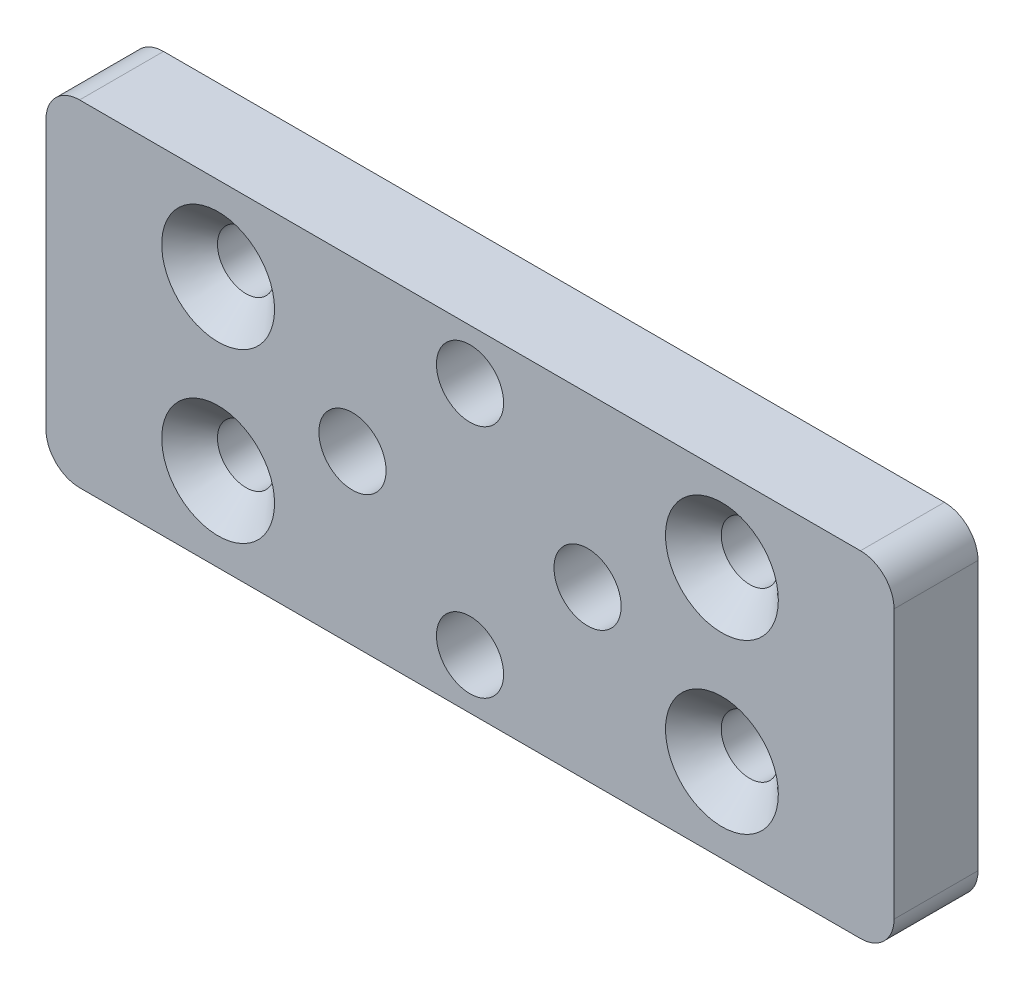
ISO-10303-21;
HEADER;
FILE_DESCRIPTION(('STEP AP214'),'2;1');
FILE_NAME('part.step','',(''),(''),'','','');
FILE_SCHEMA(('AUTOMOTIVE_DESIGN { 1 0 10303 214 1 1 1 1 }'));
ENDSEC;
DATA;
#1=APPLICATION_CONTEXT('core data for automotive mechanical design processes');
#2=APPLICATION_PROTOCOL_DEFINITION('international standard','automotive_design',2000,#1);
#3=PRODUCT_CONTEXT('',#1,'mechanical');
#4=PRODUCT('Part','Part','',(#3));
#5=PRODUCT_RELATED_PRODUCT_CATEGORY('part','',(#4));
#6=PRODUCT_DEFINITION_FORMATION('','',#4);
#7=PRODUCT_DEFINITION_CONTEXT('part definition',#1,'design');
#8=PRODUCT_DEFINITION('design','',#6,#7);
#9=PRODUCT_DEFINITION_SHAPE('','',#8);
#10=(LENGTH_UNIT() NAMED_UNIT(*) SI_UNIT(.MILLI.,.METRE.));
#11=(NAMED_UNIT(*) PLANE_ANGLE_UNIT() SI_UNIT($,.RADIAN.));
#12=(NAMED_UNIT(*) SI_UNIT($,.STERADIAN.) SOLID_ANGLE_UNIT());
#13=UNCERTAINTY_MEASURE_WITH_UNIT(LENGTH_MEASURE(1.E-05),#10,'distance_accuracy_value','');
#14=(GEOMETRIC_REPRESENTATION_CONTEXT(3) GLOBAL_UNCERTAINTY_ASSIGNED_CONTEXT((#13)) GLOBAL_UNIT_ASSIGNED_CONTEXT((#10,
#11,#12)) REPRESENTATION_CONTEXT('',''));
#15=CARTESIAN_POINT('',(0.,0.,0.));
#16=DIRECTION('',(0.,0.,1.));
#17=DIRECTION('',(1.,0.,0.));
#18=AXIS2_PLACEMENT_3D('',#15,#16,#17);
#19=CARTESIAN_POINT('',(0.,0.,5.));
#20=DIRECTION('',(1.,0.,0.));
#21=DIRECTION('',(0.,1.,0.));
#22=AXIS2_PLACEMENT_3D('',#19,#20,#21);
#23=PLANE('',#22);
#24=DIRECTION('',(0.,-1.,0.));
#25=VECTOR('',#24,1.);
#26=CARTESIAN_POINT('',(0.,0.,0.));
#27=LINE('',#26,#25);
#28=CARTESIAN_POINT('',(0.,-2.,0.));
#29=VERTEX_POINT('',#28);
#30=CARTESIAN_POINT('',(0.,-18.,0.));
#31=VERTEX_POINT('',#30);
#32=EDGE_CURVE('E158',#29,#31,#27,.T.);
#33=ORIENTED_EDGE('',*,*,#32,.T.);
#34=DIRECTION('',(0.,0.,-1.));
#35=VECTOR('',#34,1.);
#36=CARTESIAN_POINT('',(0.,-18.,5.));
#37=LINE('',#36,#35);
#38=CARTESIAN_POINT('',(0.,-18.,5.));
#39=VERTEX_POINT('',#38);
#40=EDGE_CURVE('E11',#31,#39,#37,.F.);
#41=ORIENTED_EDGE('',*,*,#40,.T.);
#42=DIRECTION('',(0.,-1.,0.));
#43=VECTOR('',#42,1.);
#44=CARTESIAN_POINT('',(0.,0.,5.));
#45=LINE('',#44,#43);
#46=CARTESIAN_POINT('',(0.,-2.,5.));
#47=VERTEX_POINT('',#46);
#48=EDGE_CURVE('E126',#47,#39,#45,.T.);
#49=ORIENTED_EDGE('',*,*,#48,.F.);
#50=DIRECTION('',(0.,0.,-1.));
#51=VECTOR('',#50,1.);
#52=CARTESIAN_POINT('',(0.,-2.,5.));
#53=LINE('',#52,#51);
#54=EDGE_CURVE('E42',#47,#29,#53,.T.);
#55=ORIENTED_EDGE('',*,*,#54,.T.);
#56=EDGE_LOOP('',(#33,#41,#49,#55));
#57=FACE_BOUND('',#56,.T.);
#58=ADVANCED_FACE('F34',(#57),#23,.F.);
#59=CARTESIAN_POINT('',(0.,-20.,5.));
#60=DIRECTION('',(0.,1.,0.));
#61=DIRECTION('',(0.,0.,1.));
#62=AXIS2_PLACEMENT_3D('',#59,#60,#61);
#63=PLANE('',#62);
#64=DIRECTION('',(1.,0.,0.));
#65=VECTOR('',#64,1.);
#66=CARTESIAN_POINT('',(0.,-20.,0.));
#67=LINE('',#66,#65);
#68=CARTESIAN_POINT('',(2.,-20.,0.));
#69=VERTEX_POINT('',#68);
#70=CARTESIAN_POINT('',(48.5,-20.,0.));
#71=VERTEX_POINT('',#70);
#72=EDGE_CURVE('E131',#69,#71,#67,.T.);
#73=ORIENTED_EDGE('',*,*,#72,.T.);
#74=DIRECTION('',(0.,0.,-1.));
#75=VECTOR('',#74,1.);
#76=CARTESIAN_POINT('',(48.5,-20.,5.));
#77=LINE('',#76,#75);
#78=CARTESIAN_POINT('',(48.5,-20.,5.));
#79=VERTEX_POINT('',#78);
#80=EDGE_CURVE('E49',#71,#79,#77,.F.);
#81=ORIENTED_EDGE('',*,*,#80,.T.);
#82=DIRECTION('',(1.,0.,0.));
#83=VECTOR('',#82,1.);
#84=CARTESIAN_POINT('',(0.,-20.,5.));
#85=LINE('',#84,#83);
#86=CARTESIAN_POINT('',(2.,-20.,5.));
#87=VERTEX_POINT('',#86);
#88=EDGE_CURVE('E129',#87,#79,#85,.T.);
#89=ORIENTED_EDGE('',*,*,#88,.F.);
#90=DIRECTION('',(0.,0.,-1.));
#91=VECTOR('',#90,1.);
#92=CARTESIAN_POINT('',(2.,-20.,5.));
#93=LINE('',#92,#91);
#94=EDGE_CURVE('E150',#87,#69,#93,.T.);
#95=ORIENTED_EDGE('',*,*,#94,.T.);
#96=EDGE_LOOP('',(#73,#81,#89,#95));
#97=FACE_BOUND('',#96,.T.);
#98=ADVANCED_FACE('F264',(#97),#63,.F.);
#99=CARTESIAN_POINT('',(50.5,0.,5.));
#100=DIRECTION('',(-1.,0.,0.));
#101=DIRECTION('',(0.,0.,1.));
#102=AXIS2_PLACEMENT_3D('',#99,#100,#101);
#103=PLANE('',#102);
#104=DIRECTION('',(0.,1.,0.));
#105=VECTOR('',#104,1.);
#106=CARTESIAN_POINT('',(50.5,0.,0.));
#107=LINE('',#106,#105);
#108=CARTESIAN_POINT('',(50.5,-18.,0.));
#109=VERTEX_POINT('',#108);
#110=CARTESIAN_POINT('',(50.5,-2.,0.));
#111=VERTEX_POINT('',#110);
#112=EDGE_CURVE('E127',#109,#111,#107,.T.);
#113=ORIENTED_EDGE('',*,*,#112,.T.);
#114=DIRECTION('',(0.,0.,-1.));
#115=VECTOR('',#114,1.);
#116=CARTESIAN_POINT('',(50.5,-2.,5.));
#117=LINE('',#116,#115);
#118=CARTESIAN_POINT('',(50.5,-2.,5.));
#119=VERTEX_POINT('',#118);
#120=EDGE_CURVE('E105',#111,#119,#117,.F.);
#121=ORIENTED_EDGE('',*,*,#120,.T.);
#122=DIRECTION('',(0.,1.,0.));
#123=VECTOR('',#122,1.);
#124=CARTESIAN_POINT('',(50.5,0.,5.));
#125=LINE('',#124,#123);
#126=CARTESIAN_POINT('',(50.5,-18.,5.));
#127=VERTEX_POINT('',#126);
#128=EDGE_CURVE('E170',#127,#119,#125,.T.);
#129=ORIENTED_EDGE('',*,*,#128,.F.);
#130=DIRECTION('',(0.,0.,-1.));
#131=VECTOR('',#130,1.);
#132=CARTESIAN_POINT('',(50.5,-18.,5.));
#133=LINE('',#132,#131);
#134=EDGE_CURVE('E110',#127,#109,#133,.T.);
#135=ORIENTED_EDGE('',*,*,#134,.T.);
#136=EDGE_LOOP('',(#113,#121,#129,#135));
#137=FACE_BOUND('',#136,.T.);
#138=ADVANCED_FACE('F261',(#137),#103,.F.);
#139=CARTESIAN_POINT('',(0.,0.,5.));
#140=DIRECTION('',(0.,-1.,0.));
#141=DIRECTION('',(0.,0.,-1.));
#142=AXIS2_PLACEMENT_3D('',#139,#140,#141);
#143=PLANE('',#142);
#144=DIRECTION('',(-1.,0.,0.));
#145=VECTOR('',#144,1.);
#146=CARTESIAN_POINT('',(0.,0.,5.));
#147=LINE('',#146,#145);
#148=CARTESIAN_POINT('',(48.5,0.,5.));
#149=VERTEX_POINT('',#148);
#150=CARTESIAN_POINT('',(2.,0.,5.));
#151=VERTEX_POINT('',#150);
#152=EDGE_CURVE('E120',#149,#151,#147,.T.);
#153=ORIENTED_EDGE('',*,*,#152,.F.);
#154=DIRECTION('',(0.,0.,-1.));
#155=VECTOR('',#154,1.);
#156=CARTESIAN_POINT('',(48.5,0.,5.));
#157=LINE('',#156,#155);
#158=CARTESIAN_POINT('',(48.5,0.,0.));
#159=VERTEX_POINT('',#158);
#160=EDGE_CURVE('E104',#149,#159,#157,.T.);
#161=ORIENTED_EDGE('',*,*,#160,.T.);
#162=DIRECTION('',(-1.,0.,0.));
#163=VECTOR('',#162,1.);
#164=CARTESIAN_POINT('',(0.,0.,0.));
#165=LINE('',#164,#163);
#166=CARTESIAN_POINT('',(2.,0.,0.));
#167=VERTEX_POINT('',#166);
#168=EDGE_CURVE('E117',#159,#167,#165,.T.);
#169=ORIENTED_EDGE('',*,*,#168,.T.);
#170=DIRECTION('',(0.,0.,-1.));
#171=VECTOR('',#170,1.);
#172=CARTESIAN_POINT('',(2.,0.,5.));
#173=LINE('',#172,#171);
#174=EDGE_CURVE('E122',#167,#151,#173,.F.);
#175=ORIENTED_EDGE('',*,*,#174,.T.);
#176=EDGE_LOOP('',(#153,#161,#169,#175));
#177=FACE_BOUND('',#176,.T.);
#178=ADVANCED_FACE('F116',(#177),#143,.F.);
#179=CARTESIAN_POINT('',(0.,0.,5.));
#180=DIRECTION('',(0.,0.,1.));
#181=DIRECTION('',(1.,0.,0.));
#182=AXIS2_PLACEMENT_3D('',#179,#180,#181);
#183=PLANE('',#182);
#184=CARTESIAN_POINT('',(25.25,-3.00000000000005,5.));
#185=DIRECTION('',(0.,0.,1.));
#186=DIRECTION('',(1.,0.,0.));
#187=AXIS2_PLACEMENT_3D('',#184,#185,#186);
#188=CIRCLE('',#187,2.);
#189=CARTESIAN_POINT('',(27.25,-3.00000000000005,5.));
#190=VERTEX_POINT('',#189);
#191=EDGE_CURVE('E225',#190,#190,#188,.T.);
#192=ORIENTED_EDGE('',*,*,#191,.F.);
#193=EDGE_LOOP('',(#192));
#194=FACE_BOUND('',#193,.T.);
#195=CARTESIAN_POINT('',(32.25,-10.0000000000001,5.));
#196=DIRECTION('',(0.,0.,1.));
#197=DIRECTION('',(1.,0.,0.));
#198=AXIS2_PLACEMENT_3D('',#195,#196,#197);
#199=CIRCLE('',#198,2.);
#200=CARTESIAN_POINT('',(34.25,-10.0000000000001,5.));
#201=VERTEX_POINT('',#200);
#202=EDGE_CURVE('E219',#201,#201,#199,.T.);
#203=ORIENTED_EDGE('',*,*,#202,.F.);
#204=EDGE_LOOP('',(#203));
#205=FACE_BOUND('',#204,.T.);
#206=CARTESIAN_POINT('',(18.25,-10.,5.));
#207=DIRECTION('',(0.,0.,1.));
#208=DIRECTION('',(1.,0.,0.));
#209=AXIS2_PLACEMENT_3D('',#206,#207,#208);
#210=CIRCLE('',#209,2.);
#211=CARTESIAN_POINT('',(20.25,-10.,5.));
#212=VERTEX_POINT('',#211);
#213=EDGE_CURVE('E213',#212,#212,#210,.T.);
#214=ORIENTED_EDGE('',*,*,#213,.F.);
#215=EDGE_LOOP('',(#214));
#216=FACE_BOUND('',#215,.T.);
#217=CARTESIAN_POINT('',(25.2499999999999,-17.0000000000001,5.));
#218=DIRECTION('',(0.,0.,1.));
#219=DIRECTION('',(1.,0.,0.));
#220=AXIS2_PLACEMENT_3D('',#217,#218,#219);
#221=CIRCLE('',#220,2.);
#222=CARTESIAN_POINT('',(27.2499999999999,-17.0000000000001,5.));
#223=VERTEX_POINT('',#222);
#224=EDGE_CURVE('E207',#223,#223,#221,.T.);
#225=ORIENTED_EDGE('',*,*,#224,.F.);
#226=EDGE_LOOP('',(#225));
#227=FACE_BOUND('',#226,.T.);
#228=CARTESIAN_POINT('',(10.25,-5.,5.));
#229=DIRECTION('',(0.,0.,1.));
#230=DIRECTION('',(1.,0.,0.));
#231=AXIS2_PLACEMENT_3D('',#228,#229,#230);
#232=CIRCLE('',#231,3.36);
#233=CARTESIAN_POINT('',(13.61,-5.,5.));
#234=VERTEX_POINT('',#233);
#235=EDGE_CURVE('E203',#234,#234,#232,.T.);
#236=ORIENTED_EDGE('',*,*,#235,.F.);
#237=EDGE_LOOP('',(#236));
#238=FACE_BOUND('',#237,.T.);
#239=CARTESIAN_POINT('',(10.25,-15.,5.));
#240=DIRECTION('',(0.,0.,1.));
#241=DIRECTION('',(1.,0.,0.));
#242=AXIS2_PLACEMENT_3D('',#239,#240,#241);
#243=CIRCLE('',#242,3.36);
#244=CARTESIAN_POINT('',(13.61,-15.,5.));
#245=VERTEX_POINT('',#244);
#246=EDGE_CURVE('E194',#245,#245,#243,.T.);
#247=ORIENTED_EDGE('',*,*,#246,.F.);
#248=EDGE_LOOP('',(#247));
#249=FACE_BOUND('',#248,.T.);
#250=CARTESIAN_POINT('',(40.25,-5.,5.));
#251=DIRECTION('',(0.,0.,1.));
#252=DIRECTION('',(1.,0.,0.));
#253=AXIS2_PLACEMENT_3D('',#250,#251,#252);
#254=CIRCLE('',#253,3.36);
#255=CARTESIAN_POINT('',(43.61,-5.,5.));
#256=VERTEX_POINT('',#255);
#257=EDGE_CURVE('E185',#256,#256,#254,.T.);
#258=ORIENTED_EDGE('',*,*,#257,.F.);
#259=EDGE_LOOP('',(#258));
#260=FACE_BOUND('',#259,.T.);
#261=CARTESIAN_POINT('',(40.25,-15.,5.));
#262=DIRECTION('',(0.,0.,1.));
#263=DIRECTION('',(1.,0.,0.));
#264=AXIS2_PLACEMENT_3D('',#261,#262,#263);
#265=CIRCLE('',#264,3.36);
#266=CARTESIAN_POINT('',(43.61,-15.,5.));
#267=VERTEX_POINT('',#266);
#268=EDGE_CURVE('E176',#267,#267,#265,.T.);
#269=ORIENTED_EDGE('',*,*,#268,.F.);
#270=EDGE_LOOP('',(#269));
#271=FACE_BOUND('',#270,.T.);
#272=ORIENTED_EDGE('',*,*,#128,.T.);
#273=CARTESIAN_POINT('',(48.5,-2.,5.));
#274=DIRECTION('',(0.,0.,1.));
#275=DIRECTION('',(1.,0.,0.));
#276=AXIS2_PLACEMENT_3D('',#273,#274,#275);
#277=CIRCLE('',#276,2.);
#278=EDGE_CURVE('E148',#119,#149,#277,.T.);
#279=ORIENTED_EDGE('',*,*,#278,.T.);
#280=ORIENTED_EDGE('',*,*,#152,.T.);
#281=CARTESIAN_POINT('',(2.,-2.,5.));
#282=DIRECTION('',(0.,0.,1.));
#283=DIRECTION('',(1.,0.,0.));
#284=AXIS2_PLACEMENT_3D('',#281,#282,#283);
#285=CIRCLE('',#284,2.);
#286=EDGE_CURVE('E143',#151,#47,#285,.T.);
#287=ORIENTED_EDGE('',*,*,#286,.T.);
#288=ORIENTED_EDGE('',*,*,#48,.T.);
#289=CARTESIAN_POINT('',(2.,-18.,5.));
#290=DIRECTION('',(0.,0.,1.));
#291=DIRECTION('',(1.,0.,0.));
#292=AXIS2_PLACEMENT_3D('',#289,#290,#291);
#293=CIRCLE('',#292,2.);
#294=EDGE_CURVE('E56',#39,#87,#293,.T.);
#295=ORIENTED_EDGE('',*,*,#294,.T.);
#296=ORIENTED_EDGE('',*,*,#88,.T.);
#297=CARTESIAN_POINT('',(48.5,-18.,5.));
#298=DIRECTION('',(0.,0.,1.));
#299=DIRECTION('',(1.,0.,0.));
#300=AXIS2_PLACEMENT_3D('',#297,#298,#299);
#301=CIRCLE('',#300,2.);
#302=EDGE_CURVE('E146',#79,#127,#301,.T.);
#303=ORIENTED_EDGE('',*,*,#302,.T.);
#304=EDGE_LOOP('',(#272,#279,#280,#287,#288,#295,#296,#303));
#305=FACE_BOUND('',#304,.T.);
#306=ADVANCED_FACE('F240',(#194,#205,#216,#227,#238,#249,#260,#271,#305),#183,.T.);
#307=CARTESIAN_POINT('',(0.,0.,0.));
#308=DIRECTION('',(0.,0.,1.));
#309=DIRECTION('',(1.,0.,0.));
#310=AXIS2_PLACEMENT_3D('',#307,#308,#309);
#311=PLANE('',#310);
#312=CARTESIAN_POINT('',(25.25,-3.00000000000005,0.));
#313=DIRECTION('',(0.,0.,1.));
#314=DIRECTION('',(1.,0.,0.));
#315=AXIS2_PLACEMENT_3D('',#312,#313,#314);
#316=CIRCLE('',#315,2.);
#317=CARTESIAN_POINT('',(27.25,-3.00000000000005,0.));
#318=VERTEX_POINT('',#317);
#319=EDGE_CURVE('E206',#318,#318,#316,.T.);
#320=ORIENTED_EDGE('',*,*,#319,.T.);
#321=EDGE_LOOP('',(#320));
#322=FACE_BOUND('',#321,.T.);
#323=CARTESIAN_POINT('',(32.25,-10.0000000000001,0.));
#324=DIRECTION('',(0.,0.,1.));
#325=DIRECTION('',(1.,0.,0.));
#326=AXIS2_PLACEMENT_3D('',#323,#324,#325);
#327=CIRCLE('',#326,2.);
#328=CARTESIAN_POINT('',(34.25,-10.0000000000001,0.));
#329=VERTEX_POINT('',#328);
#330=EDGE_CURVE('E222',#329,#329,#327,.T.);
#331=ORIENTED_EDGE('',*,*,#330,.T.);
#332=EDGE_LOOP('',(#331));
#333=FACE_BOUND('',#332,.T.);
#334=CARTESIAN_POINT('',(18.25,-10.,0.));
#335=DIRECTION('',(0.,0.,1.));
#336=DIRECTION('',(1.,0.,0.));
#337=AXIS2_PLACEMENT_3D('',#334,#335,#336);
#338=CIRCLE('',#337,2.);
#339=CARTESIAN_POINT('',(20.25,-10.,0.));
#340=VERTEX_POINT('',#339);
#341=EDGE_CURVE('E216',#340,#340,#338,.T.);
#342=ORIENTED_EDGE('',*,*,#341,.T.);
#343=EDGE_LOOP('',(#342));
#344=FACE_BOUND('',#343,.T.);
#345=CARTESIAN_POINT('',(25.2499999999999,-17.0000000000001,0.));
#346=DIRECTION('',(0.,0.,1.));
#347=DIRECTION('',(1.,0.,0.));
#348=AXIS2_PLACEMENT_3D('',#345,#346,#347);
#349=CIRCLE('',#348,2.);
#350=CARTESIAN_POINT('',(27.2499999999999,-17.0000000000001,0.));
#351=VERTEX_POINT('',#350);
#352=EDGE_CURVE('E210',#351,#351,#349,.T.);
#353=ORIENTED_EDGE('',*,*,#352,.T.);
#354=EDGE_LOOP('',(#353));
#355=FACE_BOUND('',#354,.T.);
#356=CARTESIAN_POINT('',(10.25,-5.,0.));
#357=DIRECTION('',(0.,0.,1.));
#358=DIRECTION('',(1.,0.,0.));
#359=AXIS2_PLACEMENT_3D('',#356,#357,#358);
#360=CIRCLE('',#359,1.7);
#361=CARTESIAN_POINT('',(11.95,-5.,0.));
#362=VERTEX_POINT('',#361);
#363=EDGE_CURVE('E197',#362,#362,#360,.T.);
#364=ORIENTED_EDGE('',*,*,#363,.T.);
#365=EDGE_LOOP('',(#364));
#366=FACE_BOUND('',#365,.T.);
#367=CARTESIAN_POINT('',(10.25,-15.,0.));
#368=DIRECTION('',(0.,0.,1.));
#369=DIRECTION('',(1.,0.,0.));
#370=AXIS2_PLACEMENT_3D('',#367,#368,#369);
#371=CIRCLE('',#370,1.7);
#372=CARTESIAN_POINT('',(11.95,-15.,0.));
#373=VERTEX_POINT('',#372);
#374=EDGE_CURVE('E188',#373,#373,#371,.T.);
#375=ORIENTED_EDGE('',*,*,#374,.T.);
#376=EDGE_LOOP('',(#375));
#377=FACE_BOUND('',#376,.T.);
#378=CARTESIAN_POINT('',(40.25,-5.,0.));
#379=DIRECTION('',(0.,0.,1.));
#380=DIRECTION('',(1.,0.,0.));
#381=AXIS2_PLACEMENT_3D('',#378,#379,#380);
#382=CIRCLE('',#381,1.7);
#383=CARTESIAN_POINT('',(41.95,-5.,0.));
#384=VERTEX_POINT('',#383);
#385=EDGE_CURVE('E179',#384,#384,#382,.T.);
#386=ORIENTED_EDGE('',*,*,#385,.T.);
#387=EDGE_LOOP('',(#386));
#388=FACE_BOUND('',#387,.T.);
#389=CARTESIAN_POINT('',(40.25,-15.,0.));
#390=DIRECTION('',(0.,0.,1.));
#391=DIRECTION('',(1.,0.,0.));
#392=AXIS2_PLACEMENT_3D('',#389,#390,#391);
#393=CIRCLE('',#392,1.7);
#394=CARTESIAN_POINT('',(41.95,-15.,0.));
#395=VERTEX_POINT('',#394);
#396=EDGE_CURVE('E163',#395,#395,#393,.T.);
#397=ORIENTED_EDGE('',*,*,#396,.T.);
#398=EDGE_LOOP('',(#397));
#399=FACE_BOUND('',#398,.T.);
#400=ORIENTED_EDGE('',*,*,#168,.F.);
#401=CARTESIAN_POINT('',(48.5,-2.,0.));
#402=DIRECTION('',(0.,0.,1.));
#403=DIRECTION('',(1.,0.,0.));
#404=AXIS2_PLACEMENT_3D('',#401,#402,#403);
#405=CIRCLE('',#404,2.);
#406=EDGE_CURVE('E100',#159,#111,#405,.F.);
#407=ORIENTED_EDGE('',*,*,#406,.T.);
#408=ORIENTED_EDGE('',*,*,#112,.F.);
#409=CARTESIAN_POINT('',(48.5,-18.,0.));
#410=DIRECTION('',(0.,0.,1.));
#411=DIRECTION('',(1.,0.,0.));
#412=AXIS2_PLACEMENT_3D('',#409,#410,#411);
#413=CIRCLE('',#412,2.);
#414=EDGE_CURVE('E111',#109,#71,#413,.F.);
#415=ORIENTED_EDGE('',*,*,#414,.T.);
#416=ORIENTED_EDGE('',*,*,#72,.F.);
#417=CARTESIAN_POINT('',(2.,-18.,0.));
#418=DIRECTION('',(0.,0.,1.));
#419=DIRECTION('',(1.,0.,0.));
#420=AXIS2_PLACEMENT_3D('',#417,#418,#419);
#421=CIRCLE('',#420,2.);
#422=EDGE_CURVE('E137',#69,#31,#421,.F.);
#423=ORIENTED_EDGE('',*,*,#422,.T.);
#424=ORIENTED_EDGE('',*,*,#32,.F.);
#425=CARTESIAN_POINT('',(2.,-2.,0.));
#426=DIRECTION('',(0.,0.,1.));
#427=DIRECTION('',(1.,0.,0.));
#428=AXIS2_PLACEMENT_3D('',#425,#426,#427);
#429=CIRCLE('',#428,2.);
#430=EDGE_CURVE('E121',#29,#167,#429,.F.);
#431=ORIENTED_EDGE('',*,*,#430,.T.);
#432=EDGE_LOOP('',(#400,#407,#408,#415,#416,#423,#424,#431));
#433=FACE_BOUND('',#432,.T.);
#434=ADVANCED_FACE('F124',(#322,#333,#344,#355,#366,#377,#388,#399,#433),#311,.F.);
#435=CARTESIAN_POINT('',(40.25,-15.,5.));
#436=DIRECTION('',(0.,0.,1.));
#437=DIRECTION('',(1.,0.,0.));
#438=AXIS2_PLACEMENT_3D('',#435,#436,#437);
#439=CYLINDRICAL_SURFACE('',#438,1.7);
#440=ORIENTED_EDGE('',*,*,#396,.F.);
#441=EDGE_LOOP('',(#440));
#442=FACE_BOUND('',#441,.T.);
#443=CARTESIAN_POINT('',(40.25,-15.,3.34));
#444=DIRECTION('',(0.,0.,1.));
#445=DIRECTION('',(1.,0.,0.));
#446=AXIS2_PLACEMENT_3D('',#443,#444,#445);
#447=CIRCLE('',#446,1.7);
#448=CARTESIAN_POINT('',(41.95,-15.,3.34));
#449=VERTEX_POINT('',#448);
#450=EDGE_CURVE('E166',#449,#449,#447,.T.);
#451=ORIENTED_EDGE('',*,*,#450,.T.);
#452=EDGE_LOOP('',(#451));
#453=FACE_BOUND('',#452,.T.);
#454=ADVANCED_FACE('F398',(#442,#453),#439,.F.);
#455=CARTESIAN_POINT('',(40.25,-15.,5.));
#456=DIRECTION('',(0.,0.,1.));
#457=DIRECTION('',(1.,0.,0.));
#458=AXIS2_PLACEMENT_3D('',#455,#456,#457);
#459=CONICAL_SURFACE('',#458,3.36,0.785398163397449);
#460=ORIENTED_EDGE('',*,*,#450,.F.);
#461=EDGE_LOOP('',(#460));
#462=FACE_BOUND('',#461,.T.);
#463=ORIENTED_EDGE('',*,*,#268,.T.);
#464=EDGE_LOOP('',(#463));
#465=FACE_BOUND('',#464,.T.);
#466=ADVANCED_FACE('F389',(#462,#465),#459,.F.);
#467=CARTESIAN_POINT('',(40.25,-5.,5.));
#468=DIRECTION('',(0.,0.,1.));
#469=DIRECTION('',(1.,0.,0.));
#470=AXIS2_PLACEMENT_3D('',#467,#468,#469);
#471=CYLINDRICAL_SURFACE('',#470,1.7);
#472=ORIENTED_EDGE('',*,*,#385,.F.);
#473=EDGE_LOOP('',(#472));
#474=FACE_BOUND('',#473,.T.);
#475=CARTESIAN_POINT('',(40.25,-5.,3.34));
#476=DIRECTION('',(0.,0.,1.));
#477=DIRECTION('',(1.,0.,0.));
#478=AXIS2_PLACEMENT_3D('',#475,#476,#477);
#479=CIRCLE('',#478,1.7);
#480=CARTESIAN_POINT('',(41.95,-5.,3.34));
#481=VERTEX_POINT('',#480);
#482=EDGE_CURVE('E182',#481,#481,#479,.T.);
#483=ORIENTED_EDGE('',*,*,#482,.T.);
#484=EDGE_LOOP('',(#483));
#485=FACE_BOUND('',#484,.T.);
#486=ADVANCED_FACE('F380',(#474,#485),#471,.F.);
#487=CARTESIAN_POINT('',(40.25,-5.,5.));
#488=DIRECTION('',(0.,0.,1.));
#489=DIRECTION('',(1.,0.,0.));
#490=AXIS2_PLACEMENT_3D('',#487,#488,#489);
#491=CONICAL_SURFACE('',#490,3.36,0.785398163397449);
#492=ORIENTED_EDGE('',*,*,#482,.F.);
#493=EDGE_LOOP('',(#492));
#494=FACE_BOUND('',#493,.T.);
#495=ORIENTED_EDGE('',*,*,#257,.T.);
#496=EDGE_LOOP('',(#495));
#497=FACE_BOUND('',#496,.T.);
#498=ADVANCED_FACE('F371',(#494,#497),#491,.F.);
#499=CARTESIAN_POINT('',(10.25,-15.,5.));
#500=DIRECTION('',(0.,0.,1.));
#501=DIRECTION('',(1.,0.,0.));
#502=AXIS2_PLACEMENT_3D('',#499,#500,#501);
#503=CYLINDRICAL_SURFACE('',#502,1.7);
#504=ORIENTED_EDGE('',*,*,#374,.F.);
#505=EDGE_LOOP('',(#504));
#506=FACE_BOUND('',#505,.T.);
#507=CARTESIAN_POINT('',(10.25,-15.,3.34));
#508=DIRECTION('',(0.,0.,1.));
#509=DIRECTION('',(1.,0.,0.));
#510=AXIS2_PLACEMENT_3D('',#507,#508,#509);
#511=CIRCLE('',#510,1.7);
#512=CARTESIAN_POINT('',(11.95,-15.,3.34));
#513=VERTEX_POINT('',#512);
#514=EDGE_CURVE('E191',#513,#513,#511,.T.);
#515=ORIENTED_EDGE('',*,*,#514,.T.);
#516=EDGE_LOOP('',(#515));
#517=FACE_BOUND('',#516,.T.);
#518=ADVANCED_FACE('F362',(#506,#517),#503,.F.);
#519=CARTESIAN_POINT('',(10.25,-15.,5.));
#520=DIRECTION('',(0.,0.,1.));
#521=DIRECTION('',(1.,0.,0.));
#522=AXIS2_PLACEMENT_3D('',#519,#520,#521);
#523=CONICAL_SURFACE('',#522,3.36,0.785398163397449);
#524=ORIENTED_EDGE('',*,*,#514,.F.);
#525=EDGE_LOOP('',(#524));
#526=FACE_BOUND('',#525,.T.);
#527=ORIENTED_EDGE('',*,*,#246,.T.);
#528=EDGE_LOOP('',(#527));
#529=FACE_BOUND('',#528,.T.);
#530=ADVANCED_FACE('F353',(#526,#529),#523,.F.);
#531=CARTESIAN_POINT('',(10.25,-5.,5.));
#532=DIRECTION('',(0.,0.,1.));
#533=DIRECTION('',(1.,0.,0.));
#534=AXIS2_PLACEMENT_3D('',#531,#532,#533);
#535=CYLINDRICAL_SURFACE('',#534,1.7);
#536=ORIENTED_EDGE('',*,*,#363,.F.);
#537=EDGE_LOOP('',(#536));
#538=FACE_BOUND('',#537,.T.);
#539=CARTESIAN_POINT('',(10.25,-5.,3.34));
#540=DIRECTION('',(0.,0.,1.));
#541=DIRECTION('',(1.,0.,0.));
#542=AXIS2_PLACEMENT_3D('',#539,#540,#541);
#543=CIRCLE('',#542,1.7);
#544=CARTESIAN_POINT('',(11.95,-5.,3.34));
#545=VERTEX_POINT('',#544);
#546=EDGE_CURVE('E200',#545,#545,#543,.T.);
#547=ORIENTED_EDGE('',*,*,#546,.T.);
#548=EDGE_LOOP('',(#547));
#549=FACE_BOUND('',#548,.T.);
#550=ADVANCED_FACE('F344',(#538,#549),#535,.F.);
#551=CARTESIAN_POINT('',(10.25,-5.,5.));
#552=DIRECTION('',(0.,0.,1.));
#553=DIRECTION('',(1.,0.,0.));
#554=AXIS2_PLACEMENT_3D('',#551,#552,#553);
#555=CONICAL_SURFACE('',#554,3.36,0.785398163397449);
#556=ORIENTED_EDGE('',*,*,#546,.F.);
#557=EDGE_LOOP('',(#556));
#558=FACE_BOUND('',#557,.T.);
#559=ORIENTED_EDGE('',*,*,#235,.T.);
#560=EDGE_LOOP('',(#559));
#561=FACE_BOUND('',#560,.T.);
#562=ADVANCED_FACE('F335',(#558,#561),#555,.F.);
#563=CARTESIAN_POINT('',(25.2499999999999,-17.0000000000001,0.));
#564=DIRECTION('',(0.,0.,1.));
#565=DIRECTION('',(1.,0.,0.));
#566=AXIS2_PLACEMENT_3D('',#563,#564,#565);
#567=CYLINDRICAL_SURFACE('',#566,2.);
#568=ORIENTED_EDGE('',*,*,#352,.F.);
#569=EDGE_LOOP('',(#568));
#570=FACE_BOUND('',#569,.T.);
#571=ORIENTED_EDGE('',*,*,#224,.T.);
#572=EDGE_LOOP('',(#571));
#573=FACE_BOUND('',#572,.T.);
#574=ADVANCED_FACE('F326',(#570,#573),#567,.F.);
#575=CARTESIAN_POINT('',(18.25,-10.,0.));
#576=DIRECTION('',(0.,0.,1.));
#577=DIRECTION('',(1.,0.,0.));
#578=AXIS2_PLACEMENT_3D('',#575,#576,#577);
#579=CYLINDRICAL_SURFACE('',#578,2.);
#580=ORIENTED_EDGE('',*,*,#341,.F.);
#581=EDGE_LOOP('',(#580));
#582=FACE_BOUND('',#581,.T.);
#583=ORIENTED_EDGE('',*,*,#213,.T.);
#584=EDGE_LOOP('',(#583));
#585=FACE_BOUND('',#584,.T.);
#586=ADVANCED_FACE('F317',(#582,#585),#579,.F.);
#587=CARTESIAN_POINT('',(32.25,-10.0000000000001,0.));
#588=DIRECTION('',(0.,0.,1.));
#589=DIRECTION('',(1.,0.,0.));
#590=AXIS2_PLACEMENT_3D('',#587,#588,#589);
#591=CYLINDRICAL_SURFACE('',#590,2.);
#592=ORIENTED_EDGE('',*,*,#330,.F.);
#593=EDGE_LOOP('',(#592));
#594=FACE_BOUND('',#593,.T.);
#595=ORIENTED_EDGE('',*,*,#202,.T.);
#596=EDGE_LOOP('',(#595));
#597=FACE_BOUND('',#596,.T.);
#598=ADVANCED_FACE('F236',(#594,#597),#591,.F.);
#599=CARTESIAN_POINT('',(25.25,-3.00000000000005,0.));
#600=DIRECTION('',(0.,0.,1.));
#601=DIRECTION('',(1.,0.,0.));
#602=AXIS2_PLACEMENT_3D('',#599,#600,#601);
#603=CYLINDRICAL_SURFACE('',#602,2.);
#604=ORIENTED_EDGE('',*,*,#319,.F.);
#605=EDGE_LOOP('',(#604));
#606=FACE_BOUND('',#605,.T.);
#607=ORIENTED_EDGE('',*,*,#191,.T.);
#608=EDGE_LOOP('',(#607));
#609=FACE_BOUND('',#608,.T.);
#610=ADVANCED_FACE('F233',(#606,#609),#603,.F.);
#611=CARTESIAN_POINT('',(48.5,-2.,5.));
#612=DIRECTION('',(0.,0.,-1.));
#613=DIRECTION('',(-1.,0.,0.));
#614=AXIS2_PLACEMENT_3D('',#611,#612,#613);
#615=CYLINDRICAL_SURFACE('',#614,2.);
#616=ORIENTED_EDGE('',*,*,#278,.F.);
#617=ORIENTED_EDGE('',*,*,#120,.F.);
#618=ORIENTED_EDGE('',*,*,#406,.F.);
#619=ORIENTED_EDGE('',*,*,#160,.F.);
#620=EDGE_LOOP('',(#616,#617,#618,#619));
#621=FACE_BOUND('',#620,.T.);
#622=ADVANCED_FACE('F103',(#621),#615,.T.);
#623=CARTESIAN_POINT('',(48.5,-18.,5.));
#624=DIRECTION('',(0.,0.,-1.));
#625=DIRECTION('',(-1.,0.,0.));
#626=AXIS2_PLACEMENT_3D('',#623,#624,#625);
#627=CYLINDRICAL_SURFACE('',#626,2.);
#628=ORIENTED_EDGE('',*,*,#302,.F.);
#629=ORIENTED_EDGE('',*,*,#80,.F.);
#630=ORIENTED_EDGE('',*,*,#414,.F.);
#631=ORIENTED_EDGE('',*,*,#134,.F.);
#632=EDGE_LOOP('',(#628,#629,#630,#631));
#633=FACE_BOUND('',#632,.T.);
#634=ADVANCED_FACE('F263',(#633),#627,.T.);
#635=CARTESIAN_POINT('',(2.,-18.,5.));
#636=DIRECTION('',(0.,0.,-1.));
#637=DIRECTION('',(-1.,0.,0.));
#638=AXIS2_PLACEMENT_3D('',#635,#636,#637);
#639=CYLINDRICAL_SURFACE('',#638,2.);
#640=ORIENTED_EDGE('',*,*,#294,.F.);
#641=ORIENTED_EDGE('',*,*,#40,.F.);
#642=ORIENTED_EDGE('',*,*,#422,.F.);
#643=ORIENTED_EDGE('',*,*,#94,.F.);
#644=EDGE_LOOP('',(#640,#641,#642,#643));
#645=FACE_BOUND('',#644,.T.);
#646=ADVANCED_FACE('F267',(#645),#639,.T.);
#647=CARTESIAN_POINT('',(2.,-2.,5.));
#648=DIRECTION('',(0.,0.,-1.));
#649=DIRECTION('',(-1.,0.,0.));
#650=AXIS2_PLACEMENT_3D('',#647,#648,#649);
#651=CYLINDRICAL_SURFACE('',#650,2.);
#652=ORIENTED_EDGE('',*,*,#286,.F.);
#653=ORIENTED_EDGE('',*,*,#174,.F.);
#654=ORIENTED_EDGE('',*,*,#430,.F.);
#655=ORIENTED_EDGE('',*,*,#54,.F.);
#656=EDGE_LOOP('',(#652,#653,#654,#655));
#657=FACE_BOUND('',#656,.T.);
#658=ADVANCED_FACE('F36',(#657),#651,.T.);
#659=CLOSED_SHELL('',(#58,#98,#138,#178,#306,#434,#454,#466,#486,#498,#518,#530,#550,#562,#574,
#586,#598,#610,#622,#634,#646,#658));
#660=MANIFOLD_SOLID_BREP('B2',#659);
#661=ADVANCED_BREP_SHAPE_REPRESENTATION('',(#18,#660),#14);
#662=SHAPE_DEFINITION_REPRESENTATION(#9,#661);
ENDSEC;
END-ISO-10303-21;
